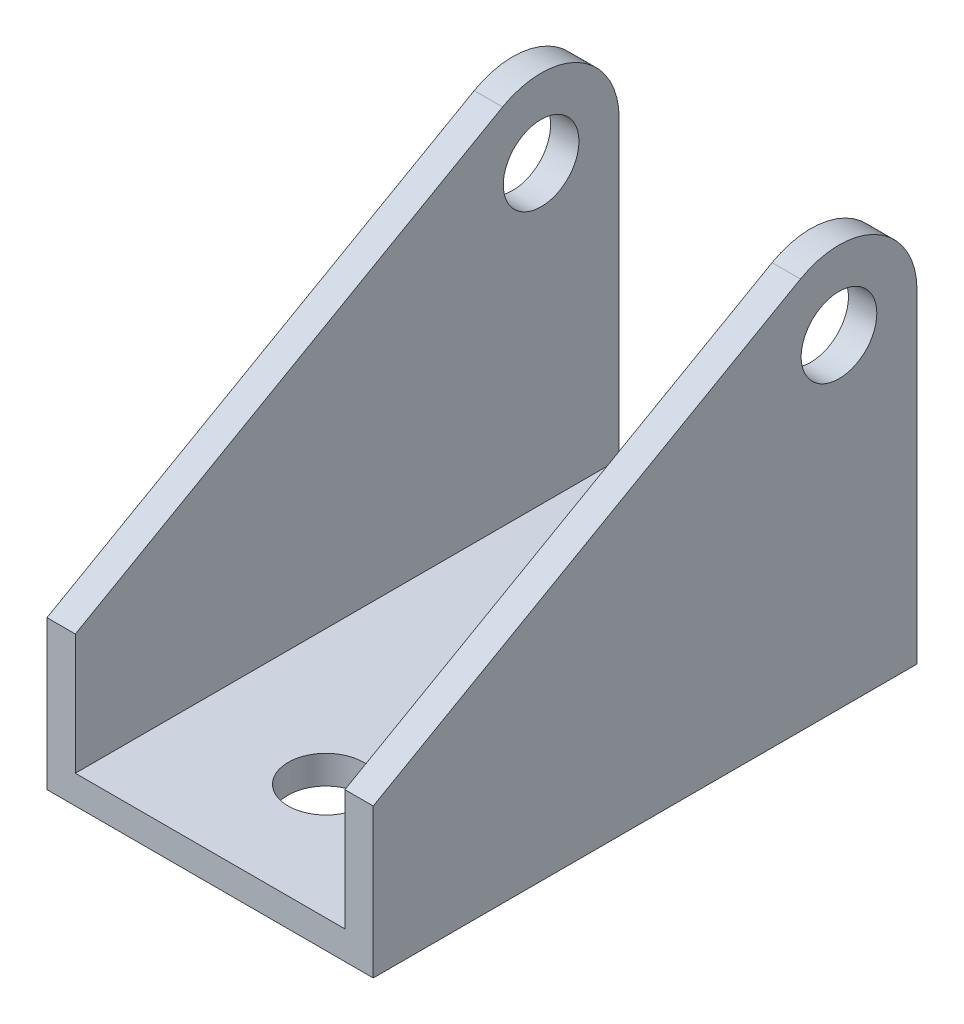
ISO-10303-21;
HEADER;
FILE_DESCRIPTION(('STEP AP214'),'2;1');
FILE_NAME('part.step','',(''),(''),'','','');
FILE_SCHEMA(('AUTOMOTIVE_DESIGN { 1 0 10303 214 1 1 1 1 }'));
ENDSEC;
DATA;
#1=APPLICATION_CONTEXT('core data for automotive mechanical design processes');
#2=APPLICATION_PROTOCOL_DEFINITION('international standard','automotive_design',2000,#1);
#3=PRODUCT_CONTEXT('',#1,'mechanical');
#4=PRODUCT('Part','Part','',(#3));
#5=PRODUCT_RELATED_PRODUCT_CATEGORY('part','',(#4));
#6=PRODUCT_DEFINITION_FORMATION('','',#4);
#7=PRODUCT_DEFINITION_CONTEXT('part definition',#1,'design');
#8=PRODUCT_DEFINITION('design','',#6,#7);
#9=PRODUCT_DEFINITION_SHAPE('','',#8);
#10=(LENGTH_UNIT() NAMED_UNIT(*) SI_UNIT(.MILLI.,.METRE.));
#11=(NAMED_UNIT(*) PLANE_ANGLE_UNIT() SI_UNIT($,.RADIAN.));
#12=(NAMED_UNIT(*) SI_UNIT($,.STERADIAN.) SOLID_ANGLE_UNIT());
#13=UNCERTAINTY_MEASURE_WITH_UNIT(LENGTH_MEASURE(1.E-05),#10,'distance_accuracy_value','');
#14=(GEOMETRIC_REPRESENTATION_CONTEXT(3) GLOBAL_UNCERTAINTY_ASSIGNED_CONTEXT((#13)) GLOBAL_UNIT_ASSIGNED_CONTEXT((#10,
#11,#12)) REPRESENTATION_CONTEXT('',''));
#15=CARTESIAN_POINT('',(0.,0.,0.));
#16=DIRECTION('',(0.,0.,1.));
#17=DIRECTION('',(1.,0.,0.));
#18=AXIS2_PLACEMENT_3D('',#15,#16,#17);
#19=CARTESIAN_POINT('',(-35.052,0.,-58.42));
#20=DIRECTION('',(0.,0.,-1.));
#21=DIRECTION('',(-1.,0.,0.));
#22=AXIS2_PLACEMENT_3D('',#19,#20,#21);
#23=PLANE('',#22);
#24=DIRECTION('',(1.,0.,0.));
#25=VECTOR('',#24,1.);
#26=CARTESIAN_POINT('',(-35.052,0.,-58.42));
#27=LINE('',#26,#25);
#28=CARTESIAN_POINT('',(-13.208,0.,-58.42));
#29=VERTEX_POINT('',#28);
#30=CARTESIAN_POINT('',(0.,0.,-58.42));
#31=VERTEX_POINT('',#30);
#32=EDGE_CURVE('E162',#29,#31,#27,.T.);
#33=ORIENTED_EDGE('',*,*,#32,.F.);
#34=DIRECTION('',(0.,-1.,0.));
#35=VECTOR('',#34,1.);
#36=CARTESIAN_POINT('',(-13.208,43.18,-58.42));
#37=LINE('',#36,#35);
#38=CARTESIAN_POINT('',(-13.208,3.048,-58.42));
#39=VERTEX_POINT('',#38);
#40=EDGE_CURVE('E154',#39,#29,#37,.T.);
#41=ORIENTED_EDGE('',*,*,#40,.F.);
#42=DIRECTION('',(1.,0.,0.));
#43=VECTOR('',#42,1.);
#44=CARTESIAN_POINT('',(-32.004,3.048,-58.42));
#45=LINE('',#44,#43);
#46=CARTESIAN_POINT('',(-3.048,3.048,-58.42));
#47=VERTEX_POINT('',#46);
#48=EDGE_CURVE('E57',#39,#47,#45,.T.);
#49=ORIENTED_EDGE('',*,*,#48,.T.);
#50=DIRECTION('',(0.,1.,0.));
#51=VECTOR('',#50,1.);
#52=CARTESIAN_POINT('',(-3.048,3.048,-58.42));
#53=LINE('',#52,#51);
#54=CARTESIAN_POINT('',(-3.048,34.798,-58.42));
#55=VERTEX_POINT('',#54);
#56=EDGE_CURVE('E201',#47,#55,#53,.T.);
#57=ORIENTED_EDGE('',*,*,#56,.T.);
#58=DIRECTION('',(1.,0.,0.));
#59=VECTOR('',#58,1.);
#60=CARTESIAN_POINT('',(-35.052,34.798,-58.42));
#61=LINE('',#60,#59);
#62=CARTESIAN_POINT('',(0.,34.798,-58.42));
#63=VERTEX_POINT('',#62);
#64=EDGE_CURVE('E161',#55,#63,#61,.T.);
#65=ORIENTED_EDGE('',*,*,#64,.T.);
#66=DIRECTION('',(0.,1.,0.));
#67=VECTOR('',#66,1.);
#68=CARTESIAN_POINT('',(0.,0.,-58.42));
#69=LINE('',#68,#67);
#70=EDGE_CURVE('E246',#31,#63,#69,.T.);
#71=ORIENTED_EDGE('',*,*,#70,.F.);
#72=EDGE_LOOP('',(#33,#41,#49,#57,#65,#71));
#73=FACE_BOUND('',#72,.T.);
#74=ADVANCED_FACE('F33',(#73),#23,.T.);
#75=CARTESIAN_POINT('',(-32.004,3.048,-58.42));
#76=VERTEX_POINT('',#75);
#77=CARTESIAN_POINT('',(-21.844,3.048,-58.42));
#78=VERTEX_POINT('',#77);
#79=EDGE_CURVE('E153',#76,#78,#45,.T.);
#80=ORIENTED_EDGE('',*,*,#79,.T.);
#81=DIRECTION('',(0.,-1.,0.));
#82=VECTOR('',#81,1.);
#83=CARTESIAN_POINT('',(-21.844,43.18,-58.42));
#84=LINE('',#83,#82);
#85=CARTESIAN_POINT('',(-21.844,0.,-58.42));
#86=VERTEX_POINT('',#85);
#87=EDGE_CURVE('E49',#78,#86,#84,.T.);
#88=ORIENTED_EDGE('',*,*,#87,.T.);
#89=CARTESIAN_POINT('',(-35.052,0.,-58.42));
#90=VERTEX_POINT('',#89);
#91=EDGE_CURVE('E149',#90,#86,#27,.T.);
#92=ORIENTED_EDGE('',*,*,#91,.F.);
#93=DIRECTION('',(0.,1.,0.));
#94=VECTOR('',#93,1.);
#95=CARTESIAN_POINT('',(-35.052,0.,-58.42));
#96=LINE('',#95,#94);
#97=CARTESIAN_POINT('',(-35.052,34.798,-58.42));
#98=VERTEX_POINT('',#97);
#99=EDGE_CURVE('E234',#90,#98,#96,.T.);
#100=ORIENTED_EDGE('',*,*,#99,.T.);
#101=CARTESIAN_POINT('',(-32.004,34.798,-58.42));
#102=VERTEX_POINT('',#101);
#103=EDGE_CURVE('E164',#98,#102,#61,.T.);
#104=ORIENTED_EDGE('',*,*,#103,.T.);
#105=DIRECTION('',(0.,-1.,0.));
#106=VECTOR('',#105,1.);
#107=CARTESIAN_POINT('',(-32.004,3.048,-58.42));
#108=LINE('',#107,#106);
#109=EDGE_CURVE('E199',#102,#76,#108,.T.);
#110=ORIENTED_EDGE('',*,*,#109,.T.);
#111=EDGE_LOOP('',(#80,#88,#92,#100,#104,#110));
#112=FACE_BOUND('',#111,.T.);
#113=ADVANCED_FACE('F147',(#112),#23,.T.);
#114=CARTESIAN_POINT('',(-35.052,0.,0.));
#115=DIRECTION('',(0.,-1.,0.));
#116=DIRECTION('',(0.,0.,-1.));
#117=AXIS2_PLACEMENT_3D('',#114,#115,#116);
#118=PLANE('',#117);
#119=CARTESIAN_POINT('',(-17.526,0.,-43.930247399116));
#120=DIRECTION('',(0.,-1.,0.));
#121=DIRECTION('',(0.,0.,-1.));
#122=AXIS2_PLACEMENT_3D('',#119,#120,#121);
#123=CIRCLE('',#122,4.318);
#124=CARTESIAN_POINT('',(-21.844,0.,-43.930247399116));
#125=VERTEX_POINT('',#124);
#126=CARTESIAN_POINT('',(-13.208,0.,-43.930247399116));
#127=VERTEX_POINT('',#126);
#128=EDGE_CURVE('E298',#125,#127,#123,.F.);
#129=ORIENTED_EDGE('',*,*,#128,.T.);
#130=DIRECTION('',(0.,0.,-1.));
#131=VECTOR('',#130,1.);
#132=CARTESIAN_POINT('',(-13.208,0.,0.));
#133=LINE('',#132,#131);
#134=EDGE_CURVE('E142',#127,#29,#133,.T.);
#135=ORIENTED_EDGE('',*,*,#134,.T.);
#136=ORIENTED_EDGE('',*,*,#32,.T.);
#137=DIRECTION('',(0.,0.,-1.));
#138=VECTOR('',#137,1.);
#139=CARTESIAN_POINT('',(0.,0.,0.));
#140=LINE('',#139,#138);
#141=CARTESIAN_POINT('',(0.,0.,0.));
#142=VERTEX_POINT('',#141);
#143=EDGE_CURVE('E243',#142,#31,#140,.T.);
#144=ORIENTED_EDGE('',*,*,#143,.F.);
#145=DIRECTION('',(1.,0.,0.));
#146=VECTOR('',#145,1.);
#147=CARTESIAN_POINT('',(-35.052,0.,0.));
#148=LINE('',#147,#146);
#149=CARTESIAN_POINT('',(-35.052,0.,0.));
#150=VERTEX_POINT('',#149);
#151=EDGE_CURVE('E166',#150,#142,#148,.T.);
#152=ORIENTED_EDGE('',*,*,#151,.F.);
#153=DIRECTION('',(0.,0.,-1.));
#154=VECTOR('',#153,1.);
#155=CARTESIAN_POINT('',(-35.052,0.,0.));
#156=LINE('',#155,#154);
#157=EDGE_CURVE('E160',#150,#90,#156,.T.);
#158=ORIENTED_EDGE('',*,*,#157,.T.);
#159=ORIENTED_EDGE('',*,*,#91,.T.);
#160=DIRECTION('',(0.,0.,1.));
#161=VECTOR('',#160,1.);
#162=CARTESIAN_POINT('',(-21.844,0.,0.));
#163=LINE('',#162,#161);
#164=EDGE_CURVE('E135',#86,#125,#163,.T.);
#165=ORIENTED_EDGE('',*,*,#164,.T.);
#166=EDGE_LOOP('',(#129,#135,#136,#144,#152,#158,#159,#165));
#167=FACE_BOUND('',#166,.T.);
#168=CARTESIAN_POINT('',(-17.526,0.,-12.446));
#169=DIRECTION('',(0.,-1.,0.));
#170=DIRECTION('',(0.,0.,-1.));
#171=AXIS2_PLACEMENT_3D('',#168,#169,#170);
#172=CIRCLE('',#171,4.064);
#173=CARTESIAN_POINT('',(-17.526,0.,-16.51));
#174=VERTEX_POINT('',#173);
#175=EDGE_CURVE('E211',#174,#174,#172,.F.);
#176=ORIENTED_EDGE('',*,*,#175,.T.);
#177=EDGE_LOOP('',(#176));
#178=FACE_BOUND('',#177,.T.);
#179=ADVANCED_FACE('F157',(#167,#178),#118,.T.);
#180=CARTESIAN_POINT('',(-32.004,3.048,-58.42));
#181=DIRECTION('',(0.,-1.,0.));
#182=DIRECTION('',(0.,0.,-1.));
#183=AXIS2_PLACEMENT_3D('',#180,#181,#182);
#184=PLANE('',#183);
#185=DIRECTION('',(0.,0.,-1.));
#186=VECTOR('',#185,1.);
#187=CARTESIAN_POINT('',(-13.208,3.048,-58.42));
#188=LINE('',#187,#186);
#189=CARTESIAN_POINT('',(-13.208,3.048,-43.930247399116));
#190=VERTEX_POINT('',#189);
#191=EDGE_CURVE('E11',#190,#39,#188,.T.);
#192=ORIENTED_EDGE('',*,*,#191,.F.);
#193=CARTESIAN_POINT('',(-17.526,3.048,-43.930247399116));
#194=DIRECTION('',(0.,-1.,0.));
#195=DIRECTION('',(0.,0.,-1.));
#196=AXIS2_PLACEMENT_3D('',#193,#194,#195);
#197=CIRCLE('',#196,4.318);
#198=CARTESIAN_POINT('',(-21.844,3.048,-43.930247399116));
#199=VERTEX_POINT('',#198);
#200=EDGE_CURVE('E42',#199,#190,#197,.F.);
#201=ORIENTED_EDGE('',*,*,#200,.F.);
#202=DIRECTION('',(0.,0.,1.));
#203=VECTOR('',#202,1.);
#204=CARTESIAN_POINT('',(-21.844,3.048,-58.42));
#205=LINE('',#204,#203);
#206=EDGE_CURVE('E181',#78,#199,#205,.T.);
#207=ORIENTED_EDGE('',*,*,#206,.F.);
#208=ORIENTED_EDGE('',*,*,#79,.F.);
#209=DIRECTION('',(0.,0.,1.));
#210=VECTOR('',#209,1.);
#211=CARTESIAN_POINT('',(-32.004,3.048,-58.42));
#212=LINE('',#211,#210);
#213=CARTESIAN_POINT('',(-32.004,3.048,0.));
#214=VERTEX_POINT('',#213);
#215=EDGE_CURVE('E207',#76,#214,#212,.T.);
#216=ORIENTED_EDGE('',*,*,#215,.T.);
#217=DIRECTION('',(1.,0.,0.));
#218=VECTOR('',#217,1.);
#219=CARTESIAN_POINT('',(-32.004,3.048,0.));
#220=LINE('',#219,#218);
#221=CARTESIAN_POINT('',(-3.048,3.048,0.));
#222=VERTEX_POINT('',#221);
#223=EDGE_CURVE('E210',#214,#222,#220,.T.);
#224=ORIENTED_EDGE('',*,*,#223,.T.);
#225=DIRECTION('',(0.,0.,1.));
#226=VECTOR('',#225,1.);
#227=CARTESIAN_POINT('',(-3.048,3.048,-58.42));
#228=LINE('',#227,#226);
#229=EDGE_CURVE('E175',#47,#222,#228,.T.);
#230=ORIENTED_EDGE('',*,*,#229,.F.);
#231=ORIENTED_EDGE('',*,*,#48,.F.);
#232=EDGE_LOOP('',(#192,#201,#207,#208,#216,#224,#230,#231));
#233=FACE_BOUND('',#232,.T.);
#234=CARTESIAN_POINT('',(-17.526,3.048,-12.446));
#235=DIRECTION('',(0.,-1.,0.));
#236=DIRECTION('',(0.,0.,-1.));
#237=AXIS2_PLACEMENT_3D('',#234,#235,#236);
#238=CIRCLE('',#237,4.064);
#239=CARTESIAN_POINT('',(-17.526,3.048,-16.51));
#240=VERTEX_POINT('',#239);
#241=EDGE_CURVE('E37',#240,#240,#238,.F.);
#242=ORIENTED_EDGE('',*,*,#241,.F.);
#243=EDGE_LOOP('',(#242));
#244=FACE_BOUND('',#243,.T.);
#245=ADVANCED_FACE('F195',(#233,#244),#184,.F.);
#246=CARTESIAN_POINT('',(-35.052,16.002,0.));
#247=DIRECTION('',(0.,0.86940917723071,0.494092787386155));
#248=DIRECTION('',(0.,-0.494092787386155,0.86940917723071));
#249=AXIS2_PLACEMENT_3D('',#246,#247,#248);
#250=PLANE('',#249);
#251=DIRECTION('',(0.,-0.494092787386155,0.86940917723071));
#252=VECTOR('',#251,1.);
#253=CARTESIAN_POINT('',(-32.004,16.002,0.));
#254=LINE('',#253,#252);
#255=CARTESIAN_POINT('',(-32.004,42.0853877235478,-45.8965142561292));
#256=VERTEX_POINT('',#255);
#257=CARTESIAN_POINT('',(-32.004,16.002,0.));
#258=VERTEX_POINT('',#257);
#259=EDGE_CURVE('E220',#256,#258,#254,.T.);
#260=ORIENTED_EDGE('',*,*,#259,.F.);
#261=DIRECTION('',(1.,0.,0.));
#262=VECTOR('',#261,1.);
#263=CARTESIAN_POINT('',(-35.052,42.0853877235478,-45.8965142561292));
#264=LINE('',#263,#262);
#265=CARTESIAN_POINT('',(-35.052,42.0853877235478,-45.8965142561292));
#266=VERTEX_POINT('',#265);
#267=EDGE_CURVE('E256',#266,#256,#264,.T.);
#268=ORIENTED_EDGE('',*,*,#267,.F.);
#269=DIRECTION('',(0.,-0.494092787386155,0.86940917723071));
#270=VECTOR('',#269,1.);
#271=CARTESIAN_POINT('',(-35.052,16.002,0.));
#272=LINE('',#271,#270);
#273=CARTESIAN_POINT('',(-35.052,16.002,0.));
#274=VERTEX_POINT('',#273);
#275=EDGE_CURVE('E170',#266,#274,#272,.T.);
#276=ORIENTED_EDGE('',*,*,#275,.T.);
#277=DIRECTION('',(1.,0.,0.));
#278=VECTOR('',#277,1.);
#279=CARTESIAN_POINT('',(-35.052,16.002,0.));
#280=LINE('',#279,#278);
#281=EDGE_CURVE('E183',#274,#258,#280,.T.);
#282=ORIENTED_EDGE('',*,*,#281,.T.);
#283=EDGE_LOOP('',(#260,#268,#276,#282));
#284=FACE_BOUND('',#283,.T.);
#285=ADVANCED_FACE('F274',(#284),#250,.T.);
#286=CARTESIAN_POINT('',(-35.052,34.798,-50.038));
#287=DIRECTION('',(1.,0.,0.));
#288=DIRECTION('',(0.,0.,-1.));
#289=AXIS2_PLACEMENT_3D('',#286,#287,#288);
#290=CYLINDRICAL_SURFACE('',#289,8.382);
#291=CARTESIAN_POINT('',(-32.004,34.798,-50.038));
#292=DIRECTION('',(-1.,0.,0.));
#293=DIRECTION('',(0.,0.,1.));
#294=AXIS2_PLACEMENT_3D('',#291,#292,#293);
#295=CIRCLE('',#294,8.382);
#296=EDGE_CURVE('E179',#102,#256,#295,.F.);
#297=ORIENTED_EDGE('',*,*,#296,.F.);
#298=ORIENTED_EDGE('',*,*,#103,.F.);
#299=CARTESIAN_POINT('',(-35.052,34.798,-50.038));
#300=DIRECTION('',(1.,0.,0.));
#301=DIRECTION('',(0.,0.,-1.));
#302=AXIS2_PLACEMENT_3D('',#299,#300,#301);
#303=CIRCLE('',#302,8.382);
#304=EDGE_CURVE('E236',#98,#266,#303,.T.);
#305=ORIENTED_EDGE('',*,*,#304,.T.);
#306=ORIENTED_EDGE('',*,*,#267,.T.);
#307=EDGE_LOOP('',(#297,#298,#305,#306));
#308=FACE_BOUND('',#307,.T.);
#309=ADVANCED_FACE('F267',(#308),#290,.T.);
#310=CARTESIAN_POINT('',(-35.052,34.798,-50.038));
#311=DIRECTION('',(1.,0.,0.));
#312=DIRECTION('',(0.,0.,-1.));
#313=AXIS2_PLACEMENT_3D('',#310,#311,#312);
#314=CYLINDRICAL_SURFACE('',#313,4.064);
#315=CARTESIAN_POINT('',(-32.004,34.798,-50.038));
#316=DIRECTION('',(-1.,0.,0.));
#317=DIRECTION('',(0.,0.,1.));
#318=AXIS2_PLACEMENT_3D('',#315,#316,#317);
#319=CIRCLE('',#318,4.064);
#320=CARTESIAN_POINT('',(-32.004,34.798,-45.974));
#321=VERTEX_POINT('',#320);
#322=EDGE_CURVE('E176',#321,#321,#319,.F.);
#323=ORIENTED_EDGE('',*,*,#322,.T.);
#324=EDGE_LOOP('',(#323));
#325=FACE_BOUND('',#324,.T.);
#326=CARTESIAN_POINT('',(-35.052,34.798,-50.038));
#327=DIRECTION('',(1.,0.,0.));
#328=DIRECTION('',(0.,0.,-1.));
#329=AXIS2_PLACEMENT_3D('',#326,#327,#328);
#330=CIRCLE('',#329,4.064);
#331=CARTESIAN_POINT('',(-35.052,34.798,-54.102));
#332=VERTEX_POINT('',#331);
#333=EDGE_CURVE('E223',#332,#332,#330,.T.);
#334=ORIENTED_EDGE('',*,*,#333,.F.);
#335=EDGE_LOOP('',(#334));
#336=FACE_BOUND('',#335,.T.);
#337=ADVANCED_FACE('F334',(#325,#336),#314,.F.);
#338=CARTESIAN_POINT('',(-35.052,0.,0.));
#339=DIRECTION('',(0.,0.,1.));
#340=DIRECTION('',(1.,0.,0.));
#341=AXIS2_PLACEMENT_3D('',#338,#339,#340);
#342=PLANE('',#341);
#343=DIRECTION('',(0.,-1.,0.));
#344=VECTOR('',#343,1.);
#345=CARTESIAN_POINT('',(-32.004,3.048,0.));
#346=LINE('',#345,#344);
#347=EDGE_CURVE('E208',#258,#214,#346,.T.);
#348=ORIENTED_EDGE('',*,*,#347,.F.);
#349=ORIENTED_EDGE('',*,*,#281,.F.);
#350=DIRECTION('',(0.,-1.,0.));
#351=VECTOR('',#350,1.);
#352=CARTESIAN_POINT('',(-35.052,0.,0.));
#353=LINE('',#352,#351);
#354=EDGE_CURVE('E229',#274,#150,#353,.T.);
#355=ORIENTED_EDGE('',*,*,#354,.T.);
#356=ORIENTED_EDGE('',*,*,#151,.T.);
#357=DIRECTION('',(0.,-1.,0.));
#358=VECTOR('',#357,1.);
#359=CARTESIAN_POINT('',(0.,0.,0.));
#360=LINE('',#359,#358);
#361=CARTESIAN_POINT('',(0.,16.002,0.));
#362=VERTEX_POINT('',#361);
#363=EDGE_CURVE('E226',#362,#142,#360,.T.);
#364=ORIENTED_EDGE('',*,*,#363,.F.);
#365=CARTESIAN_POINT('',(-3.048,16.002,0.));
#366=VERTEX_POINT('',#365);
#367=EDGE_CURVE('E255',#366,#362,#280,.T.);
#368=ORIENTED_EDGE('',*,*,#367,.F.);
#369=DIRECTION('',(0.,1.,0.));
#370=VECTOR('',#369,1.);
#371=CARTESIAN_POINT('',(-3.048,3.048,0.));
#372=LINE('',#371,#370);
#373=EDGE_CURVE('E202',#222,#366,#372,.T.);
#374=ORIENTED_EDGE('',*,*,#373,.F.);
#375=ORIENTED_EDGE('',*,*,#223,.F.);
#376=EDGE_LOOP('',(#348,#349,#355,#356,#364,#368,#374,#375));
#377=FACE_BOUND('',#376,.T.);
#378=ADVANCED_FACE('F35',(#377),#342,.T.);
#379=DIRECTION('',(0.,0.494092787386155,-0.86940917723071));
#380=VECTOR('',#379,1.);
#381=CARTESIAN_POINT('',(-3.048,16.002,0.));
#382=LINE('',#381,#380);
#383=CARTESIAN_POINT('',(-3.048,42.0853877235478,-45.8965142561292));
#384=VERTEX_POINT('',#383);
#385=EDGE_CURVE('E180',#366,#384,#382,.T.);
#386=ORIENTED_EDGE('',*,*,#385,.F.);
#387=ORIENTED_EDGE('',*,*,#367,.T.);
#388=DIRECTION('',(0.,-0.494092787386155,0.86940917723071));
#389=VECTOR('',#388,1.);
#390=CARTESIAN_POINT('',(0.,16.002,0.));
#391=LINE('',#390,#389);
#392=CARTESIAN_POINT('',(0.,42.0853877235478,-45.8965142561292));
#393=VERTEX_POINT('',#392);
#394=EDGE_CURVE('E232',#393,#362,#391,.T.);
#395=ORIENTED_EDGE('',*,*,#394,.F.);
#396=EDGE_CURVE('E258',#384,#393,#264,.T.);
#397=ORIENTED_EDGE('',*,*,#396,.F.);
#398=EDGE_LOOP('',(#386,#387,#395,#397));
#399=FACE_BOUND('',#398,.T.);
#400=ADVANCED_FACE('F289',(#399),#250,.T.);
#401=CARTESIAN_POINT('',(-3.048,34.798,-50.038));
#402=DIRECTION('',(1.,0.,0.));
#403=DIRECTION('',(0.,0.,-1.));
#404=AXIS2_PLACEMENT_3D('',#401,#402,#403);
#405=CIRCLE('',#404,8.382);
#406=EDGE_CURVE('E174',#384,#55,#405,.F.);
#407=ORIENTED_EDGE('',*,*,#406,.F.);
#408=ORIENTED_EDGE('',*,*,#396,.T.);
#409=CARTESIAN_POINT('',(0.,34.798,-50.038));
#410=DIRECTION('',(1.,0.,0.));
#411=DIRECTION('',(0.,0.,-1.));
#412=AXIS2_PLACEMENT_3D('',#409,#410,#411);
#413=CIRCLE('',#412,8.382);
#414=EDGE_CURVE('E249',#63,#393,#413,.T.);
#415=ORIENTED_EDGE('',*,*,#414,.F.);
#416=ORIENTED_EDGE('',*,*,#64,.F.);
#417=EDGE_LOOP('',(#407,#408,#415,#416));
#418=FACE_BOUND('',#417,.T.);
#419=ADVANCED_FACE('F295',(#418),#290,.T.);
#420=CARTESIAN_POINT('',(-35.052,34.798,-50.038));
#421=DIRECTION('',(1.,0.,0.));
#422=DIRECTION('',(0.,0.,-1.));
#423=AXIS2_PLACEMENT_3D('',#420,#421,#422);
#424=PLANE('',#423);
#425=ORIENTED_EDGE('',*,*,#333,.T.);
#426=EDGE_LOOP('',(#425));
#427=FACE_BOUND('',#426,.T.);
#428=ORIENTED_EDGE('',*,*,#354,.F.);
#429=ORIENTED_EDGE('',*,*,#275,.F.);
#430=ORIENTED_EDGE('',*,*,#304,.F.);
#431=ORIENTED_EDGE('',*,*,#99,.F.);
#432=ORIENTED_EDGE('',*,*,#157,.F.);
#433=EDGE_LOOP('',(#428,#429,#430,#431,#432));
#434=FACE_BOUND('',#433,.T.);
#435=ADVANCED_FACE('F271',(#427,#434),#424,.F.);
#436=CARTESIAN_POINT('',(0.,34.798,-50.038));
#437=DIRECTION('',(1.,0.,0.));
#438=DIRECTION('',(0.,0.,-1.));
#439=AXIS2_PLACEMENT_3D('',#436,#437,#438);
#440=PLANE('',#439);
#441=CARTESIAN_POINT('',(0.,34.798,-50.038));
#442=DIRECTION('',(1.,0.,0.));
#443=DIRECTION('',(0.,0.,-1.));
#444=AXIS2_PLACEMENT_3D('',#441,#442,#443);
#445=CIRCLE('',#444,4.064);
#446=CARTESIAN_POINT('',(0.,34.798,-54.102));
#447=VERTEX_POINT('',#446);
#448=EDGE_CURVE('E222',#447,#447,#445,.T.);
#449=ORIENTED_EDGE('',*,*,#448,.F.);
#450=EDGE_LOOP('',(#449));
#451=FACE_BOUND('',#450,.T.);
#452=ORIENTED_EDGE('',*,*,#363,.T.);
#453=ORIENTED_EDGE('',*,*,#143,.T.);
#454=ORIENTED_EDGE('',*,*,#70,.T.);
#455=ORIENTED_EDGE('',*,*,#414,.T.);
#456=ORIENTED_EDGE('',*,*,#394,.T.);
#457=EDGE_LOOP('',(#452,#453,#454,#455,#456));
#458=FACE_BOUND('',#457,.T.);
#459=ADVANCED_FACE('F292',(#451,#458),#440,.T.);
#460=CARTESIAN_POINT('',(-3.048,34.798,-50.038));
#461=DIRECTION('',(1.,0.,0.));
#462=DIRECTION('',(0.,0.,-1.));
#463=AXIS2_PLACEMENT_3D('',#460,#461,#462);
#464=CIRCLE('',#463,4.064);
#465=CARTESIAN_POINT('',(-3.048,34.798,-54.102));
#466=VERTEX_POINT('',#465);
#467=EDGE_CURVE('E171',#466,#466,#464,.F.);
#468=ORIENTED_EDGE('',*,*,#467,.T.);
#469=EDGE_LOOP('',(#468));
#470=FACE_BOUND('',#469,.T.);
#471=ORIENTED_EDGE('',*,*,#448,.T.);
#472=EDGE_LOOP('',(#471));
#473=FACE_BOUND('',#472,.T.);
#474=ADVANCED_FACE('F327',(#470,#473),#314,.F.);
#475=CARTESIAN_POINT('',(-32.004,3.048,-58.42));
#476=DIRECTION('',(-1.,0.,0.));
#477=DIRECTION('',(0.,0.,1.));
#478=AXIS2_PLACEMENT_3D('',#475,#476,#477);
#479=PLANE('',#478);
#480=ORIENTED_EDGE('',*,*,#259,.T.);
#481=ORIENTED_EDGE('',*,*,#347,.T.);
#482=ORIENTED_EDGE('',*,*,#215,.F.);
#483=ORIENTED_EDGE('',*,*,#109,.F.);
#484=ORIENTED_EDGE('',*,*,#296,.T.);
#485=EDGE_LOOP('',(#480,#481,#482,#483,#484));
#486=FACE_BOUND('',#485,.T.);
#487=ORIENTED_EDGE('',*,*,#322,.F.);
#488=EDGE_LOOP('',(#487));
#489=FACE_BOUND('',#488,.T.);
#490=ADVANCED_FACE('F277',(#486,#489),#479,.F.);
#491=CARTESIAN_POINT('',(-3.048,3.048,-58.42));
#492=DIRECTION('',(1.,0.,0.));
#493=DIRECTION('',(0.,0.,-1.));
#494=AXIS2_PLACEMENT_3D('',#491,#492,#493);
#495=PLANE('',#494);
#496=ORIENTED_EDGE('',*,*,#385,.T.);
#497=ORIENTED_EDGE('',*,*,#406,.T.);
#498=ORIENTED_EDGE('',*,*,#56,.F.);
#499=ORIENTED_EDGE('',*,*,#229,.T.);
#500=ORIENTED_EDGE('',*,*,#373,.T.);
#501=EDGE_LOOP('',(#496,#497,#498,#499,#500));
#502=FACE_BOUND('',#501,.T.);
#503=ORIENTED_EDGE('',*,*,#467,.F.);
#504=EDGE_LOOP('',(#503));
#505=FACE_BOUND('',#504,.T.);
#506=ADVANCED_FACE('F286',(#502,#505),#495,.F.);
#507=CARTESIAN_POINT('',(-17.526,43.18,-43.930247399116));
#508=DIRECTION('',(0.,-1.,0.));
#509=DIRECTION('',(0.,0.,-1.));
#510=AXIS2_PLACEMENT_3D('',#507,#508,#509);
#511=CYLINDRICAL_SURFACE('',#510,4.318);
#512=DIRECTION('',(0.,-1.,0.));
#513=VECTOR('',#512,1.);
#514=CARTESIAN_POINT('',(-21.844,43.18,-43.930247399116));
#515=LINE('',#514,#513);
#516=EDGE_CURVE('E138',#199,#125,#515,.T.);
#517=ORIENTED_EDGE('',*,*,#516,.F.);
#518=ORIENTED_EDGE('',*,*,#200,.T.);
#519=DIRECTION('',(0.,-1.,0.));
#520=VECTOR('',#519,1.);
#521=CARTESIAN_POINT('',(-13.208,43.18,-43.930247399116));
#522=LINE('',#521,#520);
#523=EDGE_CURVE('E143',#190,#127,#522,.T.);
#524=ORIENTED_EDGE('',*,*,#523,.T.);
#525=ORIENTED_EDGE('',*,*,#128,.F.);
#526=EDGE_LOOP('',(#517,#518,#524,#525));
#527=FACE_BOUND('',#526,.T.);
#528=ADVANCED_FACE('F188',(#527),#511,.F.);
#529=CARTESIAN_POINT('',(-13.208,43.18,-43.930247399116));
#530=DIRECTION('',(-1.,0.,0.));
#531=DIRECTION('',(0.,0.,1.));
#532=AXIS2_PLACEMENT_3D('',#529,#530,#531);
#533=PLANE('',#532);
#534=ORIENTED_EDGE('',*,*,#523,.F.);
#535=ORIENTED_EDGE('',*,*,#191,.T.);
#536=ORIENTED_EDGE('',*,*,#40,.T.);
#537=ORIENTED_EDGE('',*,*,#134,.F.);
#538=EDGE_LOOP('',(#534,#535,#536,#537));
#539=FACE_BOUND('',#538,.T.);
#540=ADVANCED_FACE('F192',(#539),#533,.T.);
#541=CARTESIAN_POINT('',(-21.844,43.18,-43.930247399116));
#542=DIRECTION('',(1.,0.,0.));
#543=DIRECTION('',(0.,0.,-1.));
#544=AXIS2_PLACEMENT_3D('',#541,#542,#543);
#545=PLANE('',#544);
#546=ORIENTED_EDGE('',*,*,#87,.F.);
#547=ORIENTED_EDGE('',*,*,#206,.T.);
#548=ORIENTED_EDGE('',*,*,#516,.T.);
#549=ORIENTED_EDGE('',*,*,#164,.F.);
#550=EDGE_LOOP('',(#546,#547,#548,#549));
#551=FACE_BOUND('',#550,.T.);
#552=ADVANCED_FACE('F136',(#551),#545,.T.);
#553=CARTESIAN_POINT('',(-17.526,43.18,-12.446));
#554=DIRECTION('',(0.,-1.,0.));
#555=DIRECTION('',(0.,0.,-1.));
#556=AXIS2_PLACEMENT_3D('',#553,#554,#555);
#557=CYLINDRICAL_SURFACE('',#556,4.064);
#558=ORIENTED_EDGE('',*,*,#175,.F.);
#559=EDGE_LOOP('',(#558));
#560=FACE_BOUND('',#559,.T.);
#561=ORIENTED_EDGE('',*,*,#241,.T.);
#562=EDGE_LOOP('',(#561));
#563=FACE_BOUND('',#562,.T.);
#564=ADVANCED_FACE('F306',(#560,#563),#557,.F.);
#565=CLOSED_SHELL('',(#74,#113,#179,#245,#285,#309,#337,#378,#400,#419,#435,#459,#474,#490,#506,
#528,#540,#552,#564));
#566=MANIFOLD_SOLID_BREP('B2',#565);
#567=ADVANCED_BREP_SHAPE_REPRESENTATION('',(#18,#566),#14);
#568=SHAPE_DEFINITION_REPRESENTATION(#9,#567);
ENDSEC;
END-ISO-10303-21;
